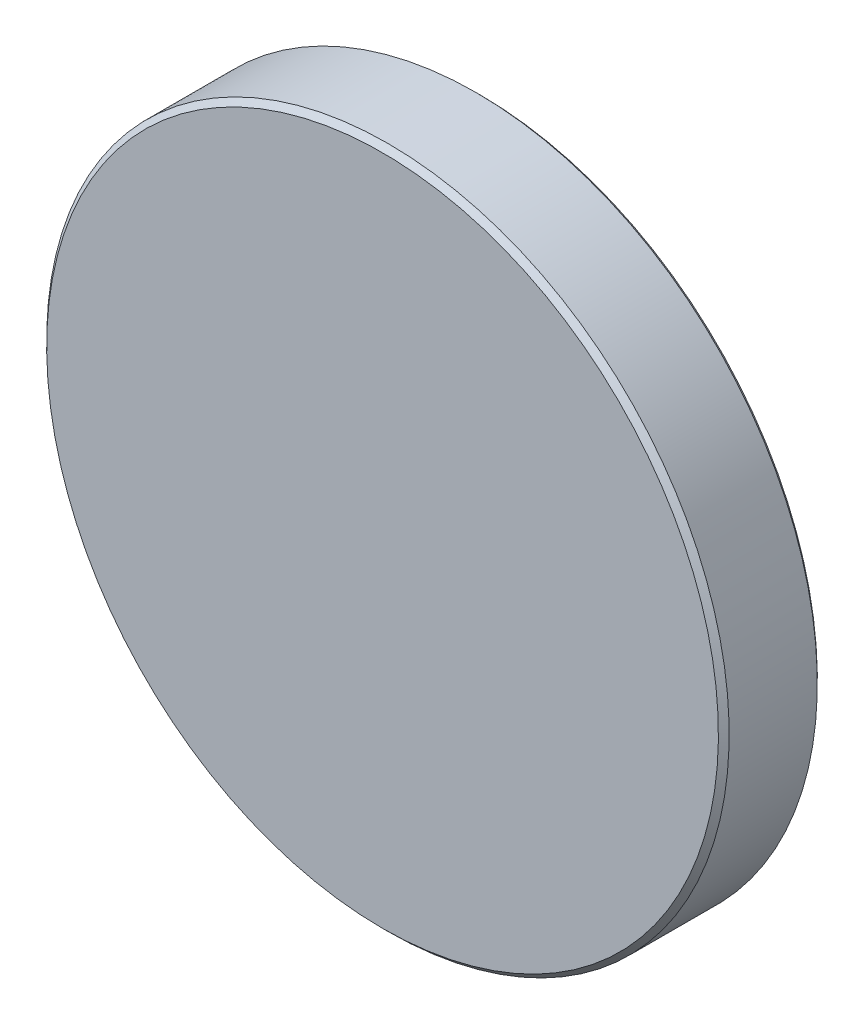
ISO-10303-21;
HEADER;
FILE_DESCRIPTION(('STEP AP214'),'2;1');
FILE_NAME('part.step','',(''),(''),'','','');
FILE_SCHEMA(('AUTOMOTIVE_DESIGN { 1 0 10303 214 1 1 1 1 }'));
ENDSEC;
DATA;
#1=APPLICATION_CONTEXT('core data for automotive mechanical design processes');
#2=APPLICATION_PROTOCOL_DEFINITION('international standard','automotive_design',2000,#1);
#3=PRODUCT_CONTEXT('',#1,'mechanical');
#4=PRODUCT('Part','Part','',(#3));
#5=PRODUCT_RELATED_PRODUCT_CATEGORY('part','',(#4));
#6=PRODUCT_DEFINITION_FORMATION('','',#4);
#7=PRODUCT_DEFINITION_CONTEXT('part definition',#1,'design');
#8=PRODUCT_DEFINITION('design','',#6,#7);
#9=PRODUCT_DEFINITION_SHAPE('','',#8);
#10=(LENGTH_UNIT() NAMED_UNIT(*) SI_UNIT(.MILLI.,.METRE.));
#11=(NAMED_UNIT(*) PLANE_ANGLE_UNIT() SI_UNIT($,.RADIAN.));
#12=(NAMED_UNIT(*) SI_UNIT($,.STERADIAN.) SOLID_ANGLE_UNIT());
#13=UNCERTAINTY_MEASURE_WITH_UNIT(LENGTH_MEASURE(1.E-05),#10,'distance_accuracy_value','');
#14=(GEOMETRIC_REPRESENTATION_CONTEXT(3) GLOBAL_UNCERTAINTY_ASSIGNED_CONTEXT((#13)) GLOBAL_UNIT_ASSIGNED_CONTEXT((#10,
#11,#12)) REPRESENTATION_CONTEXT('',''));
#15=CARTESIAN_POINT('',(0.,0.,0.));
#16=DIRECTION('',(0.,0.,1.));
#17=DIRECTION('',(1.,0.,0.));
#18=AXIS2_PLACEMENT_3D('',#15,#16,#17);
#19=CARTESIAN_POINT('',(0.,0.,207.));
#20=DIRECTION('',(0.,0.,-1.));
#21=DIRECTION('',(0.,1.,0.));
#22=AXIS2_PLACEMENT_3D('',#19,#20,#21);
#23=SPHERICAL_SURFACE('',#22,209.);
#24=CARTESIAN_POINT('',(0.,0.,-1.62234324838848));
#25=DIRECTION('',(0.,0.,-1.));
#26=DIRECTION('',(0.,1.,0.));
#27=AXIS2_PLACEMENT_3D('',#24,#25,#26);
#28=CIRCLE('',#27,12.5585786437627);
#29=CARTESIAN_POINT('',(0.,12.5585786437627,-1.62234324838848));
#30=VERTEX_POINT('',#29);
#31=EDGE_CURVE('E28',#30,#30,#28,.T.);
#32=ORIENTED_EDGE('',*,*,#31,.T.);
#33=EDGE_LOOP('',(#32));
#34=FACE_BOUND('',#33,.T.);
#35=ADVANCED_FACE('F13',(#34),#23,.T.);
#36=CARTESIAN_POINT('',(0.,0.,2.));
#37=DIRECTION('',(0.,0.,1.));
#38=DIRECTION('',(0.,-1.,0.));
#39=AXIS2_PLACEMENT_3D('',#36,#37,#38);
#40=PLANE('',#39);
#41=CARTESIAN_POINT('',(0.,0.,2.));
#42=DIRECTION('',(0.,0.,1.));
#43=DIRECTION('',(0.,-1.,0.));
#44=AXIS2_PLACEMENT_3D('',#41,#42,#43);
#45=CIRCLE('',#44,12.5);
#46=CARTESIAN_POINT('',(0.,-12.5,2.));
#47=VERTEX_POINT('',#46);
#48=EDGE_CURVE('E9',#47,#47,#45,.T.);
#49=ORIENTED_EDGE('',*,*,#48,.T.);
#50=EDGE_LOOP('',(#49));
#51=FACE_BOUND('',#50,.T.);
#52=ADVANCED_FACE('F46',(#51),#40,.T.);
#53=CARTESIAN_POINT('',(0.,0.,-2.));
#54=DIRECTION('',(0.,0.,-1.));
#55=DIRECTION('',(0.,1.,0.));
#56=AXIS2_PLACEMENT_3D('',#53,#54,#55);
#57=CYLINDRICAL_SURFACE('',#56,12.7);
#58=CARTESIAN_POINT('',(0.,0.,1.8));
#59=DIRECTION('',(0.,0.,1.));
#60=DIRECTION('',(0.,-1.,0.));
#61=AXIS2_PLACEMENT_3D('',#58,#59,#60);
#62=CIRCLE('',#61,12.7);
#63=CARTESIAN_POINT('',(0.,-12.7,1.8));
#64=VERTEX_POINT('',#63);
#65=EDGE_CURVE('E20',#64,#64,#62,.F.);
#66=ORIENTED_EDGE('',*,*,#65,.T.);
#67=EDGE_LOOP('',(#66));
#68=FACE_BOUND('',#67,.T.);
#69=CARTESIAN_POINT('',(0.,0.,-1.48092189215117));
#70=DIRECTION('',(0.,0.,-1.));
#71=DIRECTION('',(0.,1.,0.));
#72=AXIS2_PLACEMENT_3D('',#69,#70,#71);
#73=CIRCLE('',#72,12.7);
#74=CARTESIAN_POINT('',(0.,12.7,-1.48092189215117));
#75=VERTEX_POINT('',#74);
#76=EDGE_CURVE('E24',#75,#75,#73,.T.);
#77=ORIENTED_EDGE('',*,*,#76,.F.);
#78=EDGE_LOOP('',(#77));
#79=FACE_BOUND('',#78,.T.);
#80=ADVANCED_FACE('F37',(#68,#79),#57,.T.);
#81=CARTESIAN_POINT('',(0.,0.,-1.62234324838848));
#82=DIRECTION('',(0.,0.,1.));
#83=DIRECTION('',(0.,-1.,0.));
#84=AXIS2_PLACEMENT_3D('',#81,#82,#83);
#85=CONICAL_SURFACE('',#84,12.5585786437627,0.78539816339745);
#86=ORIENTED_EDGE('',*,*,#76,.T.);
#87=EDGE_LOOP('',(#86));
#88=FACE_BOUND('',#87,.T.);
#89=ORIENTED_EDGE('',*,*,#31,.F.);
#90=EDGE_LOOP('',(#89));
#91=FACE_BOUND('',#90,.T.);
#92=ADVANCED_FACE('F35',(#88,#91),#85,.T.);
#93=CARTESIAN_POINT('',(0.,0.,1.8));
#94=DIRECTION('',(0.,0.,-1.));
#95=DIRECTION('',(0.,1.,0.));
#96=AXIS2_PLACEMENT_3D('',#93,#94,#95);
#97=CONICAL_SURFACE('',#96,12.7,0.785398163397457);
#98=ORIENTED_EDGE('',*,*,#48,.F.);
#99=EDGE_LOOP('',(#98));
#100=FACE_BOUND('',#99,.T.);
#101=ORIENTED_EDGE('',*,*,#65,.F.);
#102=EDGE_LOOP('',(#101));
#103=FACE_BOUND('',#102,.T.);
#104=ADVANCED_FACE('F15',(#100,#103),#97,.T.);
#105=CLOSED_SHELL('',(#35,#52,#80,#92,#104));
#106=MANIFOLD_SOLID_BREP('B1',#105);
#107=ADVANCED_BREP_SHAPE_REPRESENTATION('',(#18,#106),#14);
#108=SHAPE_DEFINITION_REPRESENTATION(#9,#107);
ENDSEC;
END-ISO-10303-21;
